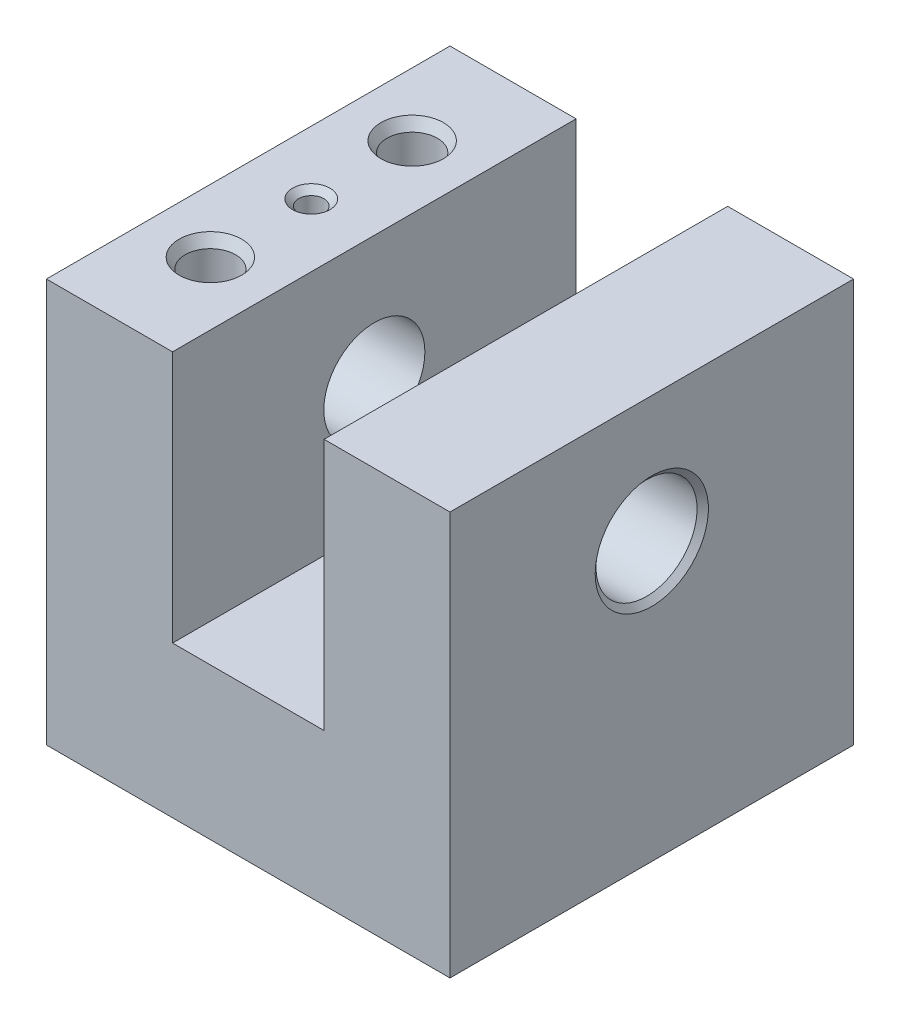
ISO-10303-21;
HEADER;
FILE_DESCRIPTION(('STEP AP214'),'2;1');
FILE_NAME('part.step','',(''),(''),'','','');
FILE_SCHEMA(('AUTOMOTIVE_DESIGN { 1 0 10303 214 1 1 1 1 }'));
ENDSEC;
DATA;
#1=APPLICATION_CONTEXT('core data for automotive mechanical design processes');
#2=APPLICATION_PROTOCOL_DEFINITION('international standard','automotive_design',2000,#1);
#3=PRODUCT_CONTEXT('',#1,'mechanical');
#4=PRODUCT('Part','Part','',(#3));
#5=PRODUCT_RELATED_PRODUCT_CATEGORY('part','',(#4));
#6=PRODUCT_DEFINITION_FORMATION('','',#4);
#7=PRODUCT_DEFINITION_CONTEXT('part definition',#1,'design');
#8=PRODUCT_DEFINITION('design','',#6,#7);
#9=PRODUCT_DEFINITION_SHAPE('','',#8);
#10=(LENGTH_UNIT() NAMED_UNIT(*) SI_UNIT(.MILLI.,.METRE.));
#11=(NAMED_UNIT(*) PLANE_ANGLE_UNIT() SI_UNIT($,.RADIAN.));
#12=(NAMED_UNIT(*) SI_UNIT($,.STERADIAN.) SOLID_ANGLE_UNIT());
#13=UNCERTAINTY_MEASURE_WITH_UNIT(LENGTH_MEASURE(1.E-05),#10,'distance_accuracy_value','');
#14=(GEOMETRIC_REPRESENTATION_CONTEXT(3) GLOBAL_UNCERTAINTY_ASSIGNED_CONTEXT((#13)) GLOBAL_UNIT_ASSIGNED_CONTEXT((#10,
#11,#12)) REPRESENTATION_CONTEXT('',''));
#15=CARTESIAN_POINT('',(0.,0.,0.));
#16=DIRECTION('',(0.,0.,1.));
#17=DIRECTION('',(1.,0.,0.));
#18=AXIS2_PLACEMENT_3D('',#15,#16,#17);
#19=CARTESIAN_POINT('',(0.,50.8,50.8));
#20=DIRECTION('',(1.,0.,0.));
#21=DIRECTION('',(0.,1.,0.));
#22=AXIS2_PLACEMENT_3D('',#19,#20,#21);
#23=PLANE('',#22);
#24=CARTESIAN_POINT('',(0.,34.925,25.4));
#25=DIRECTION('',(1.,0.,0.));
#26=DIRECTION('',(0.,1.,0.));
#27=AXIS2_PLACEMENT_3D('',#24,#25,#26);
#28=CIRCLE('',#27,7.02509649421591);
#29=CARTESIAN_POINT('',(0.,41.9500964942159,25.4));
#30=VERTEX_POINT('',#29);
#31=EDGE_CURVE('E49',#30,#30,#28,.T.);
#32=ORIENTED_EDGE('',*,*,#31,.T.);
#33=EDGE_LOOP('',(#32));
#34=FACE_BOUND('',#33,.T.);
#35=DIRECTION('',(0.,-1.,0.));
#36=VECTOR('',#35,1.);
#37=CARTESIAN_POINT('',(0.,50.8,0.));
#38=LINE('',#37,#36);
#39=CARTESIAN_POINT('',(0.,50.8,0.));
#40=VERTEX_POINT('',#39);
#41=CARTESIAN_POINT('',(0.,0.,0.));
#42=VERTEX_POINT('',#41);
#43=EDGE_CURVE('E141',#40,#42,#38,.T.);
#44=ORIENTED_EDGE('',*,*,#43,.T.);
#45=DIRECTION('',(0.,0.,-1.));
#46=VECTOR('',#45,1.);
#47=CARTESIAN_POINT('',(0.,0.,50.8));
#48=LINE('',#47,#46);
#49=CARTESIAN_POINT('',(0.,0.,50.8));
#50=VERTEX_POINT('',#49);
#51=EDGE_CURVE('E169',#50,#42,#48,.T.);
#52=ORIENTED_EDGE('',*,*,#51,.F.);
#53=DIRECTION('',(0.,-1.,0.));
#54=VECTOR('',#53,1.);
#55=CARTESIAN_POINT('',(0.,50.8,50.8));
#56=LINE('',#55,#54);
#57=CARTESIAN_POINT('',(0.,50.8,50.8));
#58=VERTEX_POINT('',#57);
#59=EDGE_CURVE('E156',#58,#50,#56,.T.);
#60=ORIENTED_EDGE('',*,*,#59,.F.);
#61=DIRECTION('',(0.,0.,-1.));
#62=VECTOR('',#61,1.);
#63=CARTESIAN_POINT('',(0.,50.8,50.8));
#64=LINE('',#63,#62);
#65=EDGE_CURVE('E137',#58,#40,#64,.T.);
#66=ORIENTED_EDGE('',*,*,#65,.T.);
#67=EDGE_LOOP('',(#44,#52,#60,#66));
#68=FACE_BOUND('',#67,.T.);
#69=ADVANCED_FACE('F40',(#34,#68),#23,.F.);
#70=CARTESIAN_POINT('',(0.,0.,50.8));
#71=DIRECTION('',(0.,1.,0.));
#72=DIRECTION('',(0.,0.,1.));
#73=AXIS2_PLACEMENT_3D('',#70,#71,#72);
#74=PLANE('',#73);
#75=DIRECTION('',(1.,0.,0.));
#76=VECTOR('',#75,1.);
#77=CARTESIAN_POINT('',(0.,0.,0.));
#78=LINE('',#77,#76);
#79=CARTESIAN_POINT('',(50.8,0.,0.));
#80=VERTEX_POINT('',#79);
#81=EDGE_CURVE('E144',#42,#80,#78,.T.);
#82=ORIENTED_EDGE('',*,*,#81,.T.);
#83=DIRECTION('',(0.,0.,-1.));
#84=VECTOR('',#83,1.);
#85=CARTESIAN_POINT('',(50.8,0.,50.8));
#86=LINE('',#85,#84);
#87=CARTESIAN_POINT('',(50.8,0.,50.8));
#88=VERTEX_POINT('',#87);
#89=EDGE_CURVE('E166',#88,#80,#86,.T.);
#90=ORIENTED_EDGE('',*,*,#89,.F.);
#91=DIRECTION('',(1.,0.,0.));
#92=VECTOR('',#91,1.);
#93=CARTESIAN_POINT('',(0.,0.,50.8));
#94=LINE('',#93,#92);
#95=EDGE_CURVE('E102',#50,#88,#94,.T.);
#96=ORIENTED_EDGE('',*,*,#95,.F.);
#97=ORIENTED_EDGE('',*,*,#51,.T.);
#98=EDGE_LOOP('',(#82,#90,#96,#97));
#99=FACE_BOUND('',#98,.T.);
#100=ADVANCED_FACE('F219',(#99),#74,.F.);
#101=CARTESIAN_POINT('',(50.8,0.,50.8));
#102=DIRECTION('',(-1.,0.,0.));
#103=DIRECTION('',(0.,0.,1.));
#104=AXIS2_PLACEMENT_3D('',#101,#102,#103);
#105=PLANE('',#104);
#106=CARTESIAN_POINT('',(50.8,34.925,25.4));
#107=DIRECTION('',(-1.,0.,0.));
#108=DIRECTION('',(0.,0.,1.));
#109=AXIS2_PLACEMENT_3D('',#106,#107,#108);
#110=CIRCLE('',#109,7.12470000000004);
#111=CARTESIAN_POINT('',(50.8,34.925,32.5247));
#112=VERTEX_POINT('',#111);
#113=EDGE_CURVE('E202',#112,#112,#110,.T.);
#114=ORIENTED_EDGE('',*,*,#113,.T.);
#115=EDGE_LOOP('',(#114));
#116=FACE_BOUND('',#115,.T.);
#117=DIRECTION('',(0.,1.,0.));
#118=VECTOR('',#117,1.);
#119=CARTESIAN_POINT('',(50.8,0.,0.));
#120=LINE('',#119,#118);
#121=CARTESIAN_POINT('',(50.8,50.8,0.));
#122=VERTEX_POINT('',#121);
#123=EDGE_CURVE('E147',#80,#122,#120,.T.);
#124=ORIENTED_EDGE('',*,*,#123,.T.);
#125=DIRECTION('',(0.,0.,-1.));
#126=VECTOR('',#125,1.);
#127=CARTESIAN_POINT('',(50.8,50.8,50.8));
#128=LINE('',#127,#126);
#129=CARTESIAN_POINT('',(50.8,50.8,50.8));
#130=VERTEX_POINT('',#129);
#131=EDGE_CURVE('E163',#130,#122,#128,.T.);
#132=ORIENTED_EDGE('',*,*,#131,.F.);
#133=DIRECTION('',(0.,1.,0.));
#134=VECTOR('',#133,1.);
#135=CARTESIAN_POINT('',(50.8,0.,50.8));
#136=LINE('',#135,#134);
#137=EDGE_CURVE('E280',#88,#130,#136,.T.);
#138=ORIENTED_EDGE('',*,*,#137,.F.);
#139=ORIENTED_EDGE('',*,*,#89,.T.);
#140=EDGE_LOOP('',(#124,#132,#138,#139));
#141=FACE_BOUND('',#140,.T.);
#142=ADVANCED_FACE('F224',(#116,#141),#105,.F.);
#143=CARTESIAN_POINT('',(50.8,50.8,50.8));
#144=DIRECTION('',(0.,-1.,0.));
#145=DIRECTION('',(0.,0.,-1.));
#146=AXIS2_PLACEMENT_3D('',#143,#144,#145);
#147=PLANE('',#146);
#148=DIRECTION('',(-1.,0.,0.));
#149=VECTOR('',#148,1.);
#150=CARTESIAN_POINT('',(50.8,50.8,0.));
#151=LINE('',#150,#149);
#152=CARTESIAN_POINT('',(34.9504,50.8,0.));
#153=VERTEX_POINT('',#152);
#154=EDGE_CURVE('E149',#122,#153,#151,.T.);
#155=ORIENTED_EDGE('',*,*,#154,.T.);
#156=DIRECTION('',(0.,0.,-1.));
#157=VECTOR('',#156,1.);
#158=CARTESIAN_POINT('',(34.9504,50.8,50.8));
#159=LINE('',#158,#157);
#160=CARTESIAN_POINT('',(34.9504,50.8,50.8));
#161=VERTEX_POINT('',#160);
#162=EDGE_CURVE('E160',#161,#153,#159,.T.);
#163=ORIENTED_EDGE('',*,*,#162,.F.);
#164=DIRECTION('',(-1.,0.,0.));
#165=VECTOR('',#164,1.);
#166=CARTESIAN_POINT('',(50.8,50.8,50.8));
#167=LINE('',#166,#165);
#168=EDGE_CURVE('E282',#130,#161,#167,.T.);
#169=ORIENTED_EDGE('',*,*,#168,.F.);
#170=ORIENTED_EDGE('',*,*,#131,.T.);
#171=EDGE_LOOP('',(#155,#163,#169,#170));
#172=FACE_BOUND('',#171,.T.);
#173=ADVANCED_FACE('F288',(#172),#147,.F.);
#174=CARTESIAN_POINT('',(34.9504,50.8,50.8));
#175=DIRECTION('',(1.,0.,0.));
#176=DIRECTION('',(0.,1.,0.));
#177=AXIS2_PLACEMENT_3D('',#174,#175,#176);
#178=PLANE('',#177);
#179=CARTESIAN_POINT('',(34.9504,34.925,25.4));
#180=DIRECTION('',(1.,0.,0.));
#181=DIRECTION('',(0.,1.,0.));
#182=AXIS2_PLACEMENT_3D('',#179,#180,#181);
#183=CIRCLE('',#182,6.3627);
#184=CARTESIAN_POINT('',(34.9504,41.2877,25.4));
#185=VERTEX_POINT('',#184);
#186=EDGE_CURVE('E145',#185,#185,#183,.T.);
#187=ORIENTED_EDGE('',*,*,#186,.T.);
#188=EDGE_LOOP('',(#187));
#189=FACE_BOUND('',#188,.T.);
#190=DIRECTION('',(0.,-1.,0.));
#191=VECTOR('',#190,1.);
#192=CARTESIAN_POINT('',(34.9504,50.8,0.));
#193=LINE('',#192,#191);
#194=CARTESIAN_POINT('',(34.9504,19.05,0.));
#195=VERTEX_POINT('',#194);
#196=EDGE_CURVE('E151',#153,#195,#193,.T.);
#197=ORIENTED_EDGE('',*,*,#196,.T.);
#198=DIRECTION('',(0.,0.,-1.));
#199=VECTOR('',#198,1.);
#200=CARTESIAN_POINT('',(34.9504,19.05,50.8));
#201=LINE('',#200,#199);
#202=CARTESIAN_POINT('',(34.9504,19.05,50.8));
#203=VERTEX_POINT('',#202);
#204=EDGE_CURVE('E132',#203,#195,#201,.T.);
#205=ORIENTED_EDGE('',*,*,#204,.F.);
#206=DIRECTION('',(0.,-1.,0.));
#207=VECTOR('',#206,1.);
#208=CARTESIAN_POINT('',(34.9504,50.8,50.8));
#209=LINE('',#208,#207);
#210=EDGE_CURVE('E123',#161,#203,#209,.T.);
#211=ORIENTED_EDGE('',*,*,#210,.F.);
#212=ORIENTED_EDGE('',*,*,#162,.T.);
#213=EDGE_LOOP('',(#197,#205,#211,#212));
#214=FACE_BOUND('',#213,.T.);
#215=ADVANCED_FACE('F292',(#189,#214),#178,.F.);
#216=CARTESIAN_POINT('',(34.9504,19.05,50.8));
#217=DIRECTION('',(0.,-1.,0.));
#218=DIRECTION('',(1.,0.,0.));
#219=AXIS2_PLACEMENT_3D('',#216,#217,#218);
#220=PLANE('',#219);
#221=DIRECTION('',(-1.,0.,0.));
#222=VECTOR('',#221,1.);
#223=CARTESIAN_POINT('',(34.9504,19.05,0.));
#224=LINE('',#223,#222);
#225=CARTESIAN_POINT('',(15.875,19.05,0.));
#226=VERTEX_POINT('',#225);
#227=EDGE_CURVE('E131',#195,#226,#224,.T.);
#228=ORIENTED_EDGE('',*,*,#227,.T.);
#229=DIRECTION('',(0.,0.,-1.));
#230=VECTOR('',#229,1.);
#231=CARTESIAN_POINT('',(15.875,19.05,50.8));
#232=LINE('',#231,#230);
#233=CARTESIAN_POINT('',(15.875,19.05,50.8));
#234=VERTEX_POINT('',#233);
#235=EDGE_CURVE('E128',#234,#226,#232,.T.);
#236=ORIENTED_EDGE('',*,*,#235,.F.);
#237=DIRECTION('',(-1.,0.,0.));
#238=VECTOR('',#237,1.);
#239=CARTESIAN_POINT('',(34.9504,19.05,50.8));
#240=LINE('',#239,#238);
#241=EDGE_CURVE('E117',#203,#234,#240,.T.);
#242=ORIENTED_EDGE('',*,*,#241,.F.);
#243=ORIENTED_EDGE('',*,*,#204,.T.);
#244=EDGE_LOOP('',(#228,#236,#242,#243));
#245=FACE_BOUND('',#244,.T.);
#246=ADVANCED_FACE('F129',(#245),#220,.F.);
#247=CARTESIAN_POINT('',(15.875,19.05,50.8));
#248=DIRECTION('',(-1.,0.,0.));
#249=DIRECTION('',(0.,-1.,0.));
#250=AXIS2_PLACEMENT_3D('',#247,#248,#249);
#251=PLANE('',#250);
#252=CARTESIAN_POINT('',(15.875,34.925,25.4));
#253=DIRECTION('',(-1.,0.,0.));
#254=DIRECTION('',(0.,-1.,0.));
#255=AXIS2_PLACEMENT_3D('',#252,#253,#254);
#256=CIRCLE('',#255,6.3627);
#257=CARTESIAN_POINT('',(15.875,28.5623,25.4));
#258=VERTEX_POINT('',#257);
#259=EDGE_CURVE('E184',#258,#258,#256,.T.);
#260=ORIENTED_EDGE('',*,*,#259,.T.);
#261=EDGE_LOOP('',(#260));
#262=FACE_BOUND('',#261,.T.);
#263=DIRECTION('',(0.,1.,0.));
#264=VECTOR('',#263,1.);
#265=CARTESIAN_POINT('',(15.875,19.05,0.));
#266=LINE('',#265,#264);
#267=CARTESIAN_POINT('',(15.875,50.8,0.));
#268=VERTEX_POINT('',#267);
#269=EDGE_CURVE('E87',#226,#268,#266,.T.);
#270=ORIENTED_EDGE('',*,*,#269,.T.);
#271=DIRECTION('',(0.,0.,-1.));
#272=VECTOR('',#271,1.);
#273=CARTESIAN_POINT('',(15.875,50.8,50.8));
#274=LINE('',#273,#272);
#275=CARTESIAN_POINT('',(15.875,50.8,50.8));
#276=VERTEX_POINT('',#275);
#277=EDGE_CURVE('E133',#276,#268,#274,.T.);
#278=ORIENTED_EDGE('',*,*,#277,.F.);
#279=DIRECTION('',(0.,1.,0.));
#280=VECTOR('',#279,1.);
#281=CARTESIAN_POINT('',(15.875,19.05,50.8));
#282=LINE('',#281,#280);
#283=EDGE_CURVE('E121',#234,#276,#282,.T.);
#284=ORIENTED_EDGE('',*,*,#283,.F.);
#285=ORIENTED_EDGE('',*,*,#235,.T.);
#286=EDGE_LOOP('',(#270,#278,#284,#285));
#287=FACE_BOUND('',#286,.T.);
#288=ADVANCED_FACE('F135',(#262,#287),#251,.F.);
#289=CARTESIAN_POINT('',(15.875,50.8,50.8));
#290=DIRECTION('',(0.,-1.,0.));
#291=DIRECTION('',(0.,0.,-1.));
#292=AXIS2_PLACEMENT_3D('',#289,#290,#291);
#293=PLANE('',#292);
#294=CARTESIAN_POINT('',(7.9375,50.8,38.1));
#295=DIRECTION('',(0.,-1.,0.));
#296=DIRECTION('',(0.,0.,-1.));
#297=AXIS2_PLACEMENT_3D('',#294,#295,#296);
#298=CIRCLE('',#297,3.93699999999999);
#299=CARTESIAN_POINT('',(7.9375,50.8,34.163));
#300=VERTEX_POINT('',#299);
#301=EDGE_CURVE('E193',#300,#300,#298,.T.);
#302=ORIENTED_EDGE('',*,*,#301,.T.);
#303=EDGE_LOOP('',(#302));
#304=FACE_BOUND('',#303,.T.);
#305=CARTESIAN_POINT('',(7.9375,50.8,12.7));
#306=DIRECTION('',(0.,-1.,0.));
#307=DIRECTION('',(0.,0.,-1.));
#308=AXIS2_PLACEMENT_3D('',#305,#306,#307);
#309=CIRCLE('',#308,3.93699999999999);
#310=CARTESIAN_POINT('',(7.9375,50.8,8.76300000000001));
#311=VERTEX_POINT('',#310);
#312=EDGE_CURVE('E190',#311,#311,#309,.T.);
#313=ORIENTED_EDGE('',*,*,#312,.T.);
#314=EDGE_LOOP('',(#313));
#315=FACE_BOUND('',#314,.T.);
#316=CARTESIAN_POINT('',(7.9375,50.8,25.4));
#317=DIRECTION('',(0.,-1.,0.));
#318=DIRECTION('',(0.,0.,-1.));
#319=AXIS2_PLACEMENT_3D('',#316,#317,#318);
#320=CIRCLE('',#319,2.34950000000005);
#321=CARTESIAN_POINT('',(7.9375,50.8,23.0505));
#322=VERTEX_POINT('',#321);
#323=EDGE_CURVE('E180',#322,#322,#320,.T.);
#324=ORIENTED_EDGE('',*,*,#323,.T.);
#325=EDGE_LOOP('',(#324));
#326=FACE_BOUND('',#325,.T.);
#327=DIRECTION('',(-1.,0.,0.));
#328=VECTOR('',#327,1.);
#329=CARTESIAN_POINT('',(15.875,50.8,0.));
#330=LINE('',#329,#328);
#331=EDGE_CURVE('E93',#268,#40,#330,.T.);
#332=ORIENTED_EDGE('',*,*,#331,.T.);
#333=ORIENTED_EDGE('',*,*,#65,.F.);
#334=DIRECTION('',(-1.,0.,0.));
#335=VECTOR('',#334,1.);
#336=CARTESIAN_POINT('',(15.875,50.8,50.8));
#337=LINE('',#336,#335);
#338=EDGE_CURVE('E57',#276,#58,#337,.T.);
#339=ORIENTED_EDGE('',*,*,#338,.F.);
#340=ORIENTED_EDGE('',*,*,#277,.T.);
#341=EDGE_LOOP('',(#332,#333,#339,#340));
#342=FACE_BOUND('',#341,.T.);
#343=ADVANCED_FACE('F299',(#304,#315,#326,#342),#293,.F.);
#344=CARTESIAN_POINT('',(0.,0.,50.8));
#345=DIRECTION('',(0.,0.,1.));
#346=DIRECTION('',(1.,0.,0.));
#347=AXIS2_PLACEMENT_3D('',#344,#345,#346);
#348=PLANE('',#347);
#349=ORIENTED_EDGE('',*,*,#59,.T.);
#350=ORIENTED_EDGE('',*,*,#95,.T.);
#351=ORIENTED_EDGE('',*,*,#137,.T.);
#352=ORIENTED_EDGE('',*,*,#168,.T.);
#353=ORIENTED_EDGE('',*,*,#210,.T.);
#354=ORIENTED_EDGE('',*,*,#241,.T.);
#355=ORIENTED_EDGE('',*,*,#283,.T.);
#356=ORIENTED_EDGE('',*,*,#338,.T.);
#357=EDGE_LOOP('',(#349,#350,#351,#352,#353,#354,#355,#356));
#358=FACE_BOUND('',#357,.T.);
#359=ADVANCED_FACE('F119',(#358),#348,.T.);
#360=CARTESIAN_POINT('',(0.,0.,0.));
#361=DIRECTION('',(0.,0.,1.));
#362=DIRECTION('',(1.,0.,0.));
#363=AXIS2_PLACEMENT_3D('',#360,#361,#362);
#364=PLANE('',#363);
#365=ORIENTED_EDGE('',*,*,#43,.F.);
#366=ORIENTED_EDGE('',*,*,#331,.F.);
#367=ORIENTED_EDGE('',*,*,#269,.F.);
#368=ORIENTED_EDGE('',*,*,#227,.F.);
#369=ORIENTED_EDGE('',*,*,#196,.F.);
#370=ORIENTED_EDGE('',*,*,#154,.F.);
#371=ORIENTED_EDGE('',*,*,#123,.F.);
#372=ORIENTED_EDGE('',*,*,#81,.F.);
#373=EDGE_LOOP('',(#365,#366,#367,#368,#369,#370,#371,#372));
#374=FACE_BOUND('',#373,.T.);
#375=ADVANCED_FACE('F295',(#374),#364,.F.);
#376=CARTESIAN_POINT('',(7.9375,43.18,25.4));
#377=DIRECTION('',(0.,1.,0.));
#378=DIRECTION('',(0.,0.,1.));
#379=AXIS2_PLACEMENT_3D('',#376,#377,#378);
#380=CYLINDRICAL_SURFACE('',#379,1.5875);
#381=CARTESIAN_POINT('',(7.9375,50.0379999999999,25.4));
#382=DIRECTION('',(0.,-1.,0.));
#383=DIRECTION('',(0.,0.,-1.));
#384=AXIS2_PLACEMENT_3D('',#381,#382,#383);
#385=CIRCLE('',#384,1.5875);
#386=CARTESIAN_POINT('',(7.9375,50.0379999999999,23.8125));
#387=VERTEX_POINT('',#386);
#388=EDGE_CURVE('E177',#387,#387,#385,.F.);
#389=ORIENTED_EDGE('',*,*,#388,.T.);
#390=EDGE_LOOP('',(#389));
#391=FACE_BOUND('',#390,.T.);
#392=CARTESIAN_POINT('',(7.9375,43.942,25.4));
#393=DIRECTION('',(0.,1.,0.));
#394=DIRECTION('',(0.,0.,1.));
#395=AXIS2_PLACEMENT_3D('',#392,#393,#394);
#396=CIRCLE('',#395,1.5875);
#397=CARTESIAN_POINT('',(7.9375,43.942,26.9875));
#398=VERTEX_POINT('',#397);
#399=EDGE_CURVE('E174',#398,#398,#396,.F.);
#400=ORIENTED_EDGE('',*,*,#399,.T.);
#401=EDGE_LOOP('',(#400));
#402=FACE_BOUND('',#401,.T.);
#403=ADVANCED_FACE('F346',(#391,#402),#380,.F.);
#404=CARTESIAN_POINT('',(7.9375,43.18,25.4));
#405=DIRECTION('',(0.,1.,0.));
#406=DIRECTION('',(0.,0.,1.));
#407=AXIS2_PLACEMENT_3D('',#404,#405,#406);
#408=PLANE('',#407);
#409=CARTESIAN_POINT('',(7.9375,43.18,25.4));
#410=DIRECTION('',(0.,1.,0.));
#411=DIRECTION('',(0.,0.,1.));
#412=AXIS2_PLACEMENT_3D('',#409,#410,#411);
#413=CIRCLE('',#412,0.319319034448928);
#414=CARTESIAN_POINT('',(7.9375,43.18,25.7193190344489));
#415=VERTEX_POINT('',#414);
#416=EDGE_CURVE('E171',#415,#415,#413,.T.);
#417=ORIENTED_EDGE('',*,*,#416,.T.);
#418=EDGE_LOOP('',(#417));
#419=FACE_BOUND('',#418,.T.);
#420=ADVANCED_FACE('F232',(#419),#408,.T.);
#421=CARTESIAN_POINT('',(7.9375,43.18,25.4));
#422=DIRECTION('',(0.,1.,0.));
#423=DIRECTION('',(0.,0.,1.));
#424=AXIS2_PLACEMENT_3D('',#421,#422,#423);
#425=CONICAL_SURFACE('',#424,0.319319034448928,1.02974425867666);
#426=ORIENTED_EDGE('',*,*,#399,.F.);
#427=EDGE_LOOP('',(#426));
#428=FACE_BOUND('',#427,.T.);
#429=ORIENTED_EDGE('',*,*,#416,.F.);
#430=EDGE_LOOP('',(#429));
#431=FACE_BOUND('',#430,.T.);
#432=ADVANCED_FACE('F228',(#428,#431),#425,.F.);
#433=CARTESIAN_POINT('',(7.9375,50.0379999999999,25.4));
#434=DIRECTION('',(0.,1.,0.));
#435=DIRECTION('',(0.,0.,1.));
#436=AXIS2_PLACEMENT_3D('',#433,#434,#435);
#437=CONICAL_SURFACE('',#436,1.5875,0.785398163397443);
#438=ORIENTED_EDGE('',*,*,#323,.F.);
#439=EDGE_LOOP('',(#438));
#440=FACE_BOUND('',#439,.T.);
#441=ORIENTED_EDGE('',*,*,#388,.F.);
#442=EDGE_LOOP('',(#441));
#443=FACE_BOUND('',#442,.T.);
#444=ADVANCED_FACE('F231',(#440,#443),#437,.F.);
#445=CARTESIAN_POINT('',(0.,34.925,25.4));
#446=DIRECTION('',(1.,0.,0.));
#447=DIRECTION('',(0.,1.,0.));
#448=AXIS2_PLACEMENT_3D('',#445,#446,#447);
#449=CYLINDRICAL_SURFACE('',#448,6.3627);
#450=CARTESIAN_POINT('',(0.761999999999939,34.925,25.4));
#451=DIRECTION('',(1.,0.,0.));
#452=DIRECTION('',(0.,0.,-1.));
#453=AXIS2_PLACEMENT_3D('',#450,#451,#452);
#454=CIRCLE('',#453,6.3627);
#455=CARTESIAN_POINT('',(0.761999999999939,34.925,19.0373));
#456=VERTEX_POINT('',#455);
#457=EDGE_CURVE('E11',#456,#456,#454,.F.);
#458=ORIENTED_EDGE('',*,*,#457,.T.);
#459=EDGE_LOOP('',(#458));
#460=FACE_BOUND('',#459,.T.);
#461=ORIENTED_EDGE('',*,*,#259,.F.);
#462=EDGE_LOOP('',(#461));
#463=FACE_BOUND('',#462,.T.);
#464=ADVANCED_FACE('F236',(#460,#463),#449,.F.);
#465=CARTESIAN_POINT('',(50.137603505784,34.925,25.4));
#466=DIRECTION('',(-1.,0.,0.));
#467=DIRECTION('',(0.,0.,1.));
#468=AXIS2_PLACEMENT_3D('',#465,#466,#467);
#469=CIRCLE('',#468,6.3627);
#470=CARTESIAN_POINT('',(50.137603505784,34.925,31.7627));
#471=VERTEX_POINT('',#470);
#472=EDGE_CURVE('E199',#471,#471,#469,.F.);
#473=ORIENTED_EDGE('',*,*,#472,.T.);
#474=EDGE_LOOP('',(#473));
#475=FACE_BOUND('',#474,.T.);
#476=ORIENTED_EDGE('',*,*,#186,.F.);
#477=EDGE_LOOP('',(#476));
#478=FACE_BOUND('',#477,.T.);
#479=ADVANCED_FACE('F328',(#475,#478),#449,.F.);
#480=CARTESIAN_POINT('',(7.9375,50.8,38.1));
#481=DIRECTION('',(0.,1.,0.));
#482=DIRECTION('',(0.,0.,1.));
#483=AXIS2_PLACEMENT_3D('',#480,#481,#482);
#484=CYLINDRICAL_SURFACE('',#483,3.175);
#485=CARTESIAN_POINT('',(7.9375,49.4801772846325,38.1));
#486=DIRECTION('',(0.,-1.,0.));
#487=DIRECTION('',(0.,0.,-1.));
#488=AXIS2_PLACEMENT_3D('',#485,#486,#487);
#489=CIRCLE('',#488,3.175);
#490=CARTESIAN_POINT('',(7.9375,49.4801772846325,34.925));
#491=VERTEX_POINT('',#490);
#492=EDGE_CURVE('E183',#491,#491,#489,.F.);
#493=ORIENTED_EDGE('',*,*,#492,.T.);
#494=EDGE_LOOP('',(#493));
#495=FACE_BOUND('',#494,.T.);
#496=CARTESIAN_POINT('',(7.9375,38.1,38.1));
#497=DIRECTION('',(0.,1.,0.));
#498=DIRECTION('',(0.,0.,1.));
#499=AXIS2_PLACEMENT_3D('',#496,#497,#498);
#500=CIRCLE('',#499,3.175);
#501=CARTESIAN_POINT('',(7.9375,38.1,41.275));
#502=VERTEX_POINT('',#501);
#503=EDGE_CURVE('E187',#502,#502,#500,.T.);
#504=ORIENTED_EDGE('',*,*,#503,.F.);
#505=EDGE_LOOP('',(#504));
#506=FACE_BOUND('',#505,.T.);
#507=ADVANCED_FACE('F331',(#495,#506),#484,.F.);
#508=CARTESIAN_POINT('',(10.4902,38.1,38.1));
#509=DIRECTION('',(0.,-1.,0.));
#510=DIRECTION('',(0.,0.,-1.));
#511=AXIS2_PLACEMENT_3D('',#508,#509,#510);
#512=PLANE('',#511);
#513=CARTESIAN_POINT('',(7.9375,38.1,38.1));
#514=DIRECTION('',(0.,1.,0.));
#515=DIRECTION('',(0.,0.,1.));
#516=AXIS2_PLACEMENT_3D('',#513,#514,#515);
#517=CIRCLE('',#516,2.5527);
#518=CARTESIAN_POINT('',(7.9375,38.1,40.6527));
#519=VERTEX_POINT('',#518);
#520=EDGE_CURVE('E265',#519,#519,#517,.T.);
#521=ORIENTED_EDGE('',*,*,#520,.F.);
#522=EDGE_LOOP('',(#521));
#523=FACE_BOUND('',#522,.T.);
#524=ORIENTED_EDGE('',*,*,#503,.T.);
#525=EDGE_LOOP('',(#524));
#526=FACE_BOUND('',#525,.T.);
#527=ADVANCED_FACE('F338',(#523,#526),#512,.F.);
#528=CARTESIAN_POINT('',(7.9375,50.8,38.1));
#529=DIRECTION('',(0.,1.,0.));
#530=DIRECTION('',(0.,0.,1.));
#531=AXIS2_PLACEMENT_3D('',#528,#529,#530);
#532=CYLINDRICAL_SURFACE('',#531,2.5527);
#533=CARTESIAN_POINT('',(7.9375,34.29,38.1));
#534=DIRECTION('',(0.,1.,0.));
#535=DIRECTION('',(0.,0.,1.));
#536=AXIS2_PLACEMENT_3D('',#533,#534,#535);
#537=CIRCLE('',#536,2.5527);
#538=CARTESIAN_POINT('',(7.9375,34.29,40.6527));
#539=VERTEX_POINT('',#538);
#540=EDGE_CURVE('E261',#539,#539,#537,.T.);
#541=ORIENTED_EDGE('',*,*,#540,.F.);
#542=EDGE_LOOP('',(#541));
#543=FACE_BOUND('',#542,.T.);
#544=ORIENTED_EDGE('',*,*,#520,.T.);
#545=EDGE_LOOP('',(#544));
#546=FACE_BOUND('',#545,.T.);
#547=ADVANCED_FACE('F398',(#543,#546),#532,.F.);
#548=CARTESIAN_POINT('',(7.9375,34.29,38.1));
#549=DIRECTION('',(0.,1.,0.));
#550=DIRECTION('',(0.,0.,1.));
#551=AXIS2_PLACEMENT_3D('',#548,#549,#550);
#552=CONICAL_SURFACE('',#551,2.5527,1.02974425867665);
#553=CARTESIAN_POINT('',(7.93749999999999,32.7561830978083,38.1));
#554=VERTEX_POINT('',#553);
#555=VERTEX_LOOP('',#554);
#556=FACE_BOUND('',#555,.T.);
#557=ORIENTED_EDGE('',*,*,#540,.T.);
#558=EDGE_LOOP('',(#557));
#559=FACE_BOUND('',#558,.T.);
#560=ADVANCED_FACE('F255',(#556,#559),#552,.F.);
#561=CARTESIAN_POINT('',(7.9375,50.8,12.7));
#562=DIRECTION('',(0.,1.,0.));
#563=DIRECTION('',(0.,0.,1.));
#564=AXIS2_PLACEMENT_3D('',#561,#562,#563);
#565=CYLINDRICAL_SURFACE('',#564,3.175);
#566=CARTESIAN_POINT('',(7.9375,49.4801772846325,12.7));
#567=DIRECTION('',(0.,-1.,0.));
#568=DIRECTION('',(0.,0.,-1.));
#569=AXIS2_PLACEMENT_3D('',#566,#567,#568);
#570=CIRCLE('',#569,3.175);
#571=CARTESIAN_POINT('',(7.9375,49.4801772846325,9.525));
#572=VERTEX_POINT('',#571);
#573=EDGE_CURVE('E196',#572,#572,#570,.F.);
#574=ORIENTED_EDGE('',*,*,#573,.T.);
#575=EDGE_LOOP('',(#574));
#576=FACE_BOUND('',#575,.T.);
#577=CARTESIAN_POINT('',(7.9375,38.1,12.7));
#578=DIRECTION('',(0.,1.,0.));
#579=DIRECTION('',(0.,0.,1.));
#580=AXIS2_PLACEMENT_3D('',#577,#578,#579);
#581=CIRCLE('',#580,3.175);
#582=CARTESIAN_POINT('',(7.9375,38.1,15.875));
#583=VERTEX_POINT('',#582);
#584=EDGE_CURVE('E259',#583,#583,#581,.T.);
#585=ORIENTED_EDGE('',*,*,#584,.F.);
#586=EDGE_LOOP('',(#585));
#587=FACE_BOUND('',#586,.T.);
#588=ADVANCED_FACE('F251',(#576,#587),#565,.F.);
#589=CARTESIAN_POINT('',(10.4902,38.1,12.7));
#590=DIRECTION('',(0.,-1.,0.));
#591=DIRECTION('',(0.,0.,-1.));
#592=AXIS2_PLACEMENT_3D('',#589,#590,#591);
#593=PLANE('',#592);
#594=CARTESIAN_POINT('',(7.9375,38.1,12.7));
#595=DIRECTION('',(0.,1.,0.));
#596=DIRECTION('',(0.,0.,1.));
#597=AXIS2_PLACEMENT_3D('',#594,#595,#596);
#598=CIRCLE('',#597,2.5527);
#599=CARTESIAN_POINT('',(7.9375,38.1,15.2527));
#600=VERTEX_POINT('',#599);
#601=EDGE_CURVE('E262',#600,#600,#598,.T.);
#602=ORIENTED_EDGE('',*,*,#601,.F.);
#603=EDGE_LOOP('',(#602));
#604=FACE_BOUND('',#603,.T.);
#605=ORIENTED_EDGE('',*,*,#584,.T.);
#606=EDGE_LOOP('',(#605));
#607=FACE_BOUND('',#606,.T.);
#608=ADVANCED_FACE('F254',(#604,#607),#593,.F.);
#609=CARTESIAN_POINT('',(7.9375,50.8,12.7));
#610=DIRECTION('',(0.,1.,0.));
#611=DIRECTION('',(0.,0.,1.));
#612=AXIS2_PLACEMENT_3D('',#609,#610,#611);
#613=CYLINDRICAL_SURFACE('',#612,2.5527);
#614=CARTESIAN_POINT('',(7.9375,34.29,12.7));
#615=DIRECTION('',(0.,1.,0.));
#616=DIRECTION('',(0.,0.,1.));
#617=AXIS2_PLACEMENT_3D('',#614,#615,#616);
#618=CIRCLE('',#617,2.5527);
#619=CARTESIAN_POINT('',(7.9375,34.29,15.2527));
#620=VERTEX_POINT('',#619);
#621=EDGE_CURVE('E268',#620,#620,#618,.T.);
#622=ORIENTED_EDGE('',*,*,#621,.F.);
#623=EDGE_LOOP('',(#622));
#624=FACE_BOUND('',#623,.T.);
#625=ORIENTED_EDGE('',*,*,#601,.T.);
#626=EDGE_LOOP('',(#625));
#627=FACE_BOUND('',#626,.T.);
#628=ADVANCED_FACE('F427',(#624,#627),#613,.F.);
#629=CARTESIAN_POINT('',(7.9375,34.29,12.7));
#630=DIRECTION('',(0.,1.,0.));
#631=DIRECTION('',(0.,0.,1.));
#632=AXIS2_PLACEMENT_3D('',#629,#630,#631);
#633=CONICAL_SURFACE('',#632,2.5527,1.02974425867665);
#634=CARTESIAN_POINT('',(7.93749999999999,32.7561830978083,12.7));
#635=VERTEX_POINT('',#634);
#636=VERTEX_LOOP('',#635);
#637=FACE_BOUND('',#636,.T.);
#638=ORIENTED_EDGE('',*,*,#621,.T.);
#639=EDGE_LOOP('',(#638));
#640=FACE_BOUND('',#639,.T.);
#641=ADVANCED_FACE('F241',(#637,#640),#633,.F.);
#642=CARTESIAN_POINT('',(7.9375,49.4801772846325,38.1));
#643=DIRECTION('',(0.,1.,0.));
#644=DIRECTION('',(0.,0.,1.));
#645=AXIS2_PLACEMENT_3D('',#642,#643,#644);
#646=CONICAL_SURFACE('',#645,3.175,0.52359877559829);
#647=ORIENTED_EDGE('',*,*,#301,.F.);
#648=EDGE_LOOP('',(#647));
#649=FACE_BOUND('',#648,.T.);
#650=ORIENTED_EDGE('',*,*,#492,.F.);
#651=EDGE_LOOP('',(#650));
#652=FACE_BOUND('',#651,.T.);
#653=ADVANCED_FACE('F238',(#649,#652),#646,.F.);
#654=CARTESIAN_POINT('',(7.9375,49.4801772846325,12.7));
#655=DIRECTION('',(0.,1.,0.));
#656=DIRECTION('',(0.,0.,1.));
#657=AXIS2_PLACEMENT_3D('',#654,#655,#656);
#658=CONICAL_SURFACE('',#657,3.175,0.523598775598299);
#659=ORIENTED_EDGE('',*,*,#312,.F.);
#660=EDGE_LOOP('',(#659));
#661=FACE_BOUND('',#660,.T.);
#662=ORIENTED_EDGE('',*,*,#573,.F.);
#663=EDGE_LOOP('',(#662));
#664=FACE_BOUND('',#663,.T.);
#665=ADVANCED_FACE('F215',(#661,#664),#658,.F.);
#666=CARTESIAN_POINT('',(50.137603505784,34.925,25.4));
#667=DIRECTION('',(1.,0.,0.));
#668=DIRECTION('',(0.,0.,-1.));
#669=AXIS2_PLACEMENT_3D('',#666,#667,#668);
#670=CONICAL_SURFACE('',#669,6.3627,0.855211333477219);
#671=ORIENTED_EDGE('',*,*,#113,.F.);
#672=EDGE_LOOP('',(#671));
#673=FACE_BOUND('',#672,.T.);
#674=ORIENTED_EDGE('',*,*,#472,.F.);
#675=EDGE_LOOP('',(#674));
#676=FACE_BOUND('',#675,.T.);
#677=ADVANCED_FACE('F210',(#673,#676),#670,.F.);
#678=CARTESIAN_POINT('',(0.,34.925,25.4));
#679=DIRECTION('',(-1.,0.,0.));
#680=DIRECTION('',(0.,0.,1.));
#681=AXIS2_PLACEMENT_3D('',#678,#679,#680);
#682=CONICAL_SURFACE('',#681,7.02509649421591,0.715584993317671);
#683=ORIENTED_EDGE('',*,*,#457,.F.);
#684=EDGE_LOOP('',(#683));
#685=FACE_BOUND('',#684,.T.);
#686=ORIENTED_EDGE('',*,*,#31,.F.);
#687=EDGE_LOOP('',(#686));
#688=FACE_BOUND('',#687,.T.);
#689=ADVANCED_FACE('F42',(#685,#688),#682,.F.);
#690=CLOSED_SHELL('',(#69,#100,#142,#173,#215,#246,#288,#343,#359,#375,#403,#420,#432,#444,#464,
#479,#507,#527,#547,#560,#588,#608,#628,#641,#653,#665,#677,#689));
#691=MANIFOLD_SOLID_BREP('B2',#690);
#692=ADVANCED_BREP_SHAPE_REPRESENTATION('',(#18,#691),#14);
#693=SHAPE_DEFINITION_REPRESENTATION(#9,#692);
ENDSEC;
END-ISO-10303-21;
